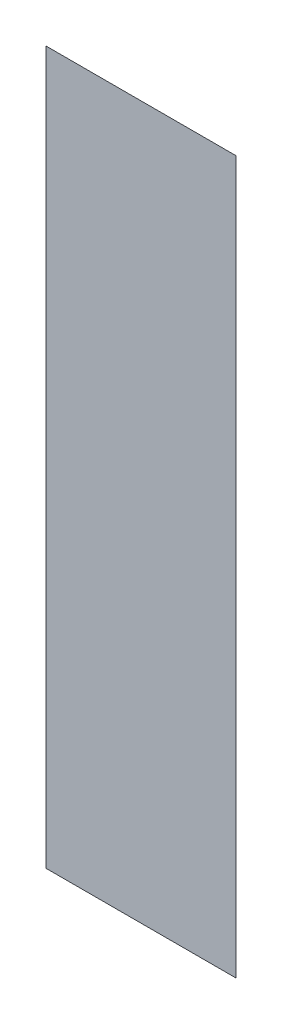
ISO-10303-21;
HEADER;
FILE_DESCRIPTION(('STEP AP214'),'2;1');
FILE_NAME('part.step','',(''),(''),'','','');
FILE_SCHEMA(('AUTOMOTIVE_DESIGN { 1 0 10303 214 1 1 1 1 }'));
ENDSEC;
DATA;
#1=APPLICATION_CONTEXT('core data for automotive mechanical design processes');
#2=APPLICATION_PROTOCOL_DEFINITION('international standard','automotive_design',2000,#1);
#3=PRODUCT_CONTEXT('',#1,'mechanical');
#4=PRODUCT('Part','Part','',(#3));
#5=PRODUCT_RELATED_PRODUCT_CATEGORY('part','',(#4));
#6=PRODUCT_DEFINITION_FORMATION('','',#4);
#7=PRODUCT_DEFINITION_CONTEXT('part definition',#1,'design');
#8=PRODUCT_DEFINITION('design','',#6,#7);
#9=PRODUCT_DEFINITION_SHAPE('','',#8);
#10=(LENGTH_UNIT() NAMED_UNIT(*) SI_UNIT(.MILLI.,.METRE.));
#11=(NAMED_UNIT(*) PLANE_ANGLE_UNIT() SI_UNIT($,.RADIAN.));
#12=(NAMED_UNIT(*) SI_UNIT($,.STERADIAN.) SOLID_ANGLE_UNIT());
#13=UNCERTAINTY_MEASURE_WITH_UNIT(LENGTH_MEASURE(1.E-05),#10,'distance_accuracy_value','');
#14=(GEOMETRIC_REPRESENTATION_CONTEXT(3) GLOBAL_UNCERTAINTY_ASSIGNED_CONTEXT((#13)) GLOBAL_UNIT_ASSIGNED_CONTEXT((#10,
#11,#12)) REPRESENTATION_CONTEXT('',''));
#15=CARTESIAN_POINT('',(0.,0.,0.));
#16=DIRECTION('',(0.,0.,1.));
#17=DIRECTION('',(1.,0.,0.));
#18=AXIS2_PLACEMENT_3D('',#15,#16,#17);
#19=CARTESIAN_POINT('',(-1.2328250745931,-0.713612688347288,0.0889425196850394));
#20=DIRECTION('',(0.,0.,1.));
#21=DIRECTION('',(0.,-1.,0.));
#22=AXIS2_PLACEMENT_3D('',#19,#20,#21);
#23=PLANE('',#22);
#24=CARTESIAN_POINT('',(-1.24340775175845,-0.715502452126816,0.0889425196850394));
#25=DIRECTION('',(1.,0.,0.));
#26=VECTOR('',#25,1.);
#27=LINE('',#24,#26);
#28=CARTESIAN_POINT('',(-1.24340775175845,-0.715502452126816,0.0890685039370079));
#29=VERTEX_POINT('',#28);
#30=CARTESIAN_POINT('',(-1.23332901160097,-0.715502452126816,0.0890685039370079));
#31=VERTEX_POINT('',#30);
#32=EDGE_CURVE('E50',#29,#31,#27,.T.);
#33=ORIENTED_EDGE('',*,*,#32,.T.);
#34=CARTESIAN_POINT('',(-1.23332901160097,-0.715502452126816,0.0889425196850394));
#35=DIRECTION('',(0.,-1.,0.));
#36=VECTOR('',#35,1.);
#37=LINE('',#34,#36);
#38=CARTESIAN_POINT('',(-1.23332901160097,-0.753297727717367,0.0890685039370079));
#39=VERTEX_POINT('',#38);
#40=EDGE_CURVE('E28',#31,#39,#37,.T.);
#41=ORIENTED_EDGE('',*,*,#40,.T.);
#42=CARTESIAN_POINT('',(-1.23332901160097,-0.753297727717367,0.0889425196850394));
#43=DIRECTION('',(-1.,0.,0.));
#44=VECTOR('',#43,1.);
#45=LINE('',#42,#44);
#46=CARTESIAN_POINT('',(-1.24340775175845,-0.753297727717367,0.0890685039370079));
#47=VERTEX_POINT('',#46);
#48=EDGE_CURVE('E11',#39,#47,#45,.T.);
#49=ORIENTED_EDGE('',*,*,#48,.T.);
#50=CARTESIAN_POINT('',(-1.24340775175845,-0.753297727717367,0.0889425196850394));
#51=DIRECTION('',(0.,1.,0.));
#52=VECTOR('',#51,1.);
#53=LINE('',#50,#52);
#54=EDGE_CURVE('E41',#47,#29,#53,.T.);
#55=ORIENTED_EDGE('',*,*,#54,.T.);
#56=EDGE_LOOP('',(#33,#41,#49,#55));
#57=FACE_BOUND('',#56,.T.);
#58=ADVANCED_FACE('F17',(#57),#23,.F.);
#59=CARTESIAN_POINT('',(-1.2328250745931,-0.713612688347288,0.0891944881889764));
#60=DIRECTION('',(0.,0.,1.));
#61=DIRECTION('',(0.,-1.,0.));
#62=AXIS2_PLACEMENT_3D('',#59,#60,#61);
#63=PLANE('',#62);
#64=ORIENTED_EDGE('',*,*,#40,.F.);
#65=ORIENTED_EDGE('',*,*,#32,.F.);
#66=ORIENTED_EDGE('',*,*,#54,.F.);
#67=ORIENTED_EDGE('',*,*,#48,.F.);
#68=EDGE_LOOP('',(#64,#65,#66,#67));
#69=FACE_BOUND('',#68,.T.);
#70=ADVANCED_FACE('F49',(#69),#63,.T.);
#71=CLOSED_SHELL('',(#58,#70));
#72=MANIFOLD_SOLID_BREP('B1',#71);
#73=ADVANCED_BREP_SHAPE_REPRESENTATION('',(#18,#72),#14);
#74=SHAPE_DEFINITION_REPRESENTATION(#9,#73);
ENDSEC;
END-ISO-10303-21;
